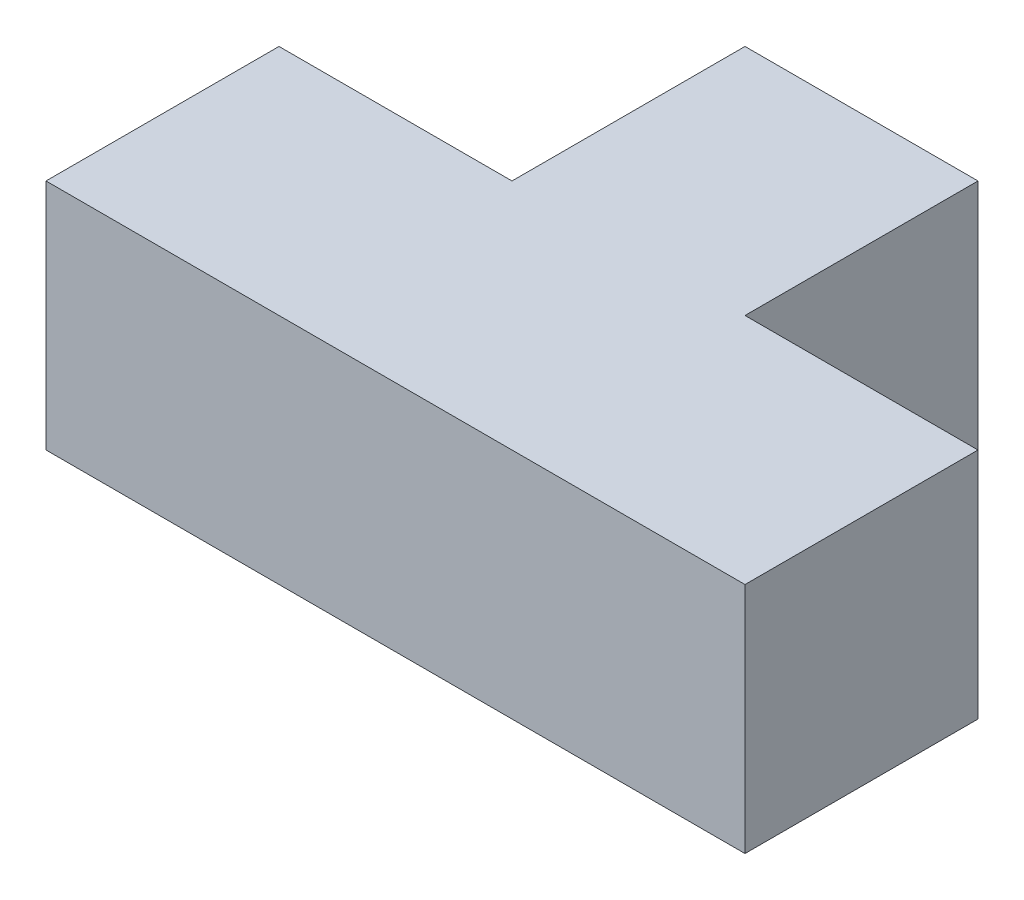
ISO-10303-21;
HEADER;
FILE_DESCRIPTION(('STEP AP214'),'2;1');
FILE_NAME('part.step','',(''),(''),'','','');
FILE_SCHEMA(('AUTOMOTIVE_DESIGN { 1 0 10303 214 1 1 1 1 }'));
ENDSEC;
DATA;
#1=APPLICATION_CONTEXT('core data for automotive mechanical design processes');
#2=APPLICATION_PROTOCOL_DEFINITION('international standard','automotive_design',2000,#1);
#3=PRODUCT_CONTEXT('',#1,'mechanical');
#4=PRODUCT('Part','Part','',(#3));
#5=PRODUCT_RELATED_PRODUCT_CATEGORY('part','',(#4));
#6=PRODUCT_DEFINITION_FORMATION('','',#4);
#7=PRODUCT_DEFINITION_CONTEXT('part definition',#1,'design');
#8=PRODUCT_DEFINITION('design','',#6,#7);
#9=PRODUCT_DEFINITION_SHAPE('','',#8);
#10=(LENGTH_UNIT() NAMED_UNIT(*) SI_UNIT(.MILLI.,.METRE.));
#11=(NAMED_UNIT(*) PLANE_ANGLE_UNIT() SI_UNIT($,.RADIAN.));
#12=(NAMED_UNIT(*) SI_UNIT($,.STERADIAN.) SOLID_ANGLE_UNIT());
#13=UNCERTAINTY_MEASURE_WITH_UNIT(LENGTH_MEASURE(1.E-05),#10,'distance_accuracy_value','');
#14=(GEOMETRIC_REPRESENTATION_CONTEXT(3) GLOBAL_UNCERTAINTY_ASSIGNED_CONTEXT((#13)) GLOBAL_UNIT_ASSIGNED_CONTEXT((#10,
#11,#12)) REPRESENTATION_CONTEXT('',''));
#15=CARTESIAN_POINT('',(0.,0.,0.));
#16=DIRECTION('',(0.,0.,1.));
#17=DIRECTION('',(1.,0.,0.));
#18=AXIS2_PLACEMENT_3D('',#15,#16,#17);
#19=CARTESIAN_POINT('',(0.,200.,0.));
#20=DIRECTION('',(1.,0.,0.));
#21=DIRECTION('',(0.,0.,-1.));
#22=AXIS2_PLACEMENT_3D('',#19,#20,#21);
#23=PLANE('',#22);
#24=DIRECTION('',(0.,0.,1.));
#25=VECTOR('',#24,1.);
#26=CARTESIAN_POINT('',(0.,0.,0.));
#27=LINE('',#26,#25);
#28=CARTESIAN_POINT('',(0.,0.,-200.));
#29=VERTEX_POINT('',#28);
#30=CARTESIAN_POINT('',(0.,0.,0.));
#31=VERTEX_POINT('',#30);
#32=EDGE_CURVE('E140',#29,#31,#27,.T.);
#33=ORIENTED_EDGE('',*,*,#32,.T.);
#34=DIRECTION('',(0.,-1.,0.));
#35=VECTOR('',#34,1.);
#36=CARTESIAN_POINT('',(0.,200.,0.));
#37=LINE('',#36,#35);
#38=CARTESIAN_POINT('',(0.,200.,0.));
#39=VERTEX_POINT('',#38);
#40=EDGE_CURVE('E11',#39,#31,#37,.T.);
#41=ORIENTED_EDGE('',*,*,#40,.F.);
#42=DIRECTION('',(0.,0.,1.));
#43=VECTOR('',#42,1.);
#44=CARTESIAN_POINT('',(0.,200.,0.));
#45=LINE('',#44,#43);
#46=CARTESIAN_POINT('',(0.,200.,-200.));
#47=VERTEX_POINT('',#46);
#48=EDGE_CURVE('E162',#47,#39,#45,.T.);
#49=ORIENTED_EDGE('',*,*,#48,.F.);
#50=DIRECTION('',(0.,-1.,0.));
#51=VECTOR('',#50,1.);
#52=CARTESIAN_POINT('',(0.,200.,-200.));
#53=LINE('',#52,#51);
#54=EDGE_CURVE('E136',#47,#29,#53,.T.);
#55=ORIENTED_EDGE('',*,*,#54,.T.);
#56=EDGE_LOOP('',(#33,#41,#49,#55));
#57=FACE_BOUND('',#56,.T.);
#58=ADVANCED_FACE('F39',(#57),#23,.F.);
#59=CARTESIAN_POINT('',(0.,200.,0.));
#60=DIRECTION('',(0.,0.,-1.));
#61=DIRECTION('',(-1.,0.,0.));
#62=AXIS2_PLACEMENT_3D('',#59,#60,#61);
#63=PLANE('',#62);
#64=DIRECTION('',(1.,0.,0.));
#65=VECTOR('',#64,1.);
#66=CARTESIAN_POINT('',(0.,0.,0.));
#67=LINE('',#66,#65);
#68=CARTESIAN_POINT('',(600.,0.,0.));
#69=VERTEX_POINT('',#68);
#70=EDGE_CURVE('E144',#31,#69,#67,.T.);
#71=ORIENTED_EDGE('',*,*,#70,.T.);
#72=DIRECTION('',(0.,-1.,0.));
#73=VECTOR('',#72,1.);
#74=CARTESIAN_POINT('',(600.,200.,0.));
#75=LINE('',#74,#73);
#76=CARTESIAN_POINT('',(600.,200.,0.));
#77=VERTEX_POINT('',#76);
#78=EDGE_CURVE('E48',#77,#69,#75,.T.);
#79=ORIENTED_EDGE('',*,*,#78,.F.);
#80=DIRECTION('',(1.,0.,0.));
#81=VECTOR('',#80,1.);
#82=CARTESIAN_POINT('',(0.,200.,0.));
#83=LINE('',#82,#81);
#84=EDGE_CURVE('E99',#39,#77,#83,.T.);
#85=ORIENTED_EDGE('',*,*,#84,.F.);
#86=ORIENTED_EDGE('',*,*,#40,.T.);
#87=EDGE_LOOP('',(#71,#79,#85,#86));
#88=FACE_BOUND('',#87,.T.);
#89=ADVANCED_FACE('F208',(#88),#63,.F.);
#90=CARTESIAN_POINT('',(600.,200.,0.));
#91=DIRECTION('',(-1.,0.,0.));
#92=DIRECTION('',(0.,0.,1.));
#93=AXIS2_PLACEMENT_3D('',#90,#91,#92);
#94=PLANE('',#93);
#95=DIRECTION('',(0.,0.,-1.));
#96=VECTOR('',#95,1.);
#97=CARTESIAN_POINT('',(600.,0.,0.));
#98=LINE('',#97,#96);
#99=CARTESIAN_POINT('',(600.,0.,-200.));
#100=VERTEX_POINT('',#99);
#101=EDGE_CURVE('E147',#69,#100,#98,.T.);
#102=ORIENTED_EDGE('',*,*,#101,.T.);
#103=DIRECTION('',(0.,-1.,0.));
#104=VECTOR('',#103,1.);
#105=CARTESIAN_POINT('',(600.,200.,-200.));
#106=LINE('',#105,#104);
#107=CARTESIAN_POINT('',(600.,200.,-200.));
#108=VERTEX_POINT('',#107);
#109=EDGE_CURVE('E173',#108,#100,#106,.T.);
#110=ORIENTED_EDGE('',*,*,#109,.F.);
#111=DIRECTION('',(0.,0.,-1.));
#112=VECTOR('',#111,1.);
#113=CARTESIAN_POINT('',(600.,200.,0.));
#114=LINE('',#113,#112);
#115=EDGE_CURVE('E183',#77,#108,#114,.T.);
#116=ORIENTED_EDGE('',*,*,#115,.F.);
#117=ORIENTED_EDGE('',*,*,#78,.T.);
#118=EDGE_LOOP('',(#102,#110,#116,#117));
#119=FACE_BOUND('',#118,.T.);
#120=ADVANCED_FACE('F181',(#119),#94,.F.);
#121=CARTESIAN_POINT('',(400.,200.,-200.));
#122=DIRECTION('',(0.,0.,1.));
#123=DIRECTION('',(1.,0.,0.));
#124=AXIS2_PLACEMENT_3D('',#121,#122,#123);
#125=PLANE('',#124);
#126=DIRECTION('',(-1.,0.,0.));
#127=VECTOR('',#126,1.);
#128=CARTESIAN_POINT('',(400.,0.,-200.));
#129=LINE('',#128,#127);
#130=CARTESIAN_POINT('',(400.,0.,-200.));
#131=VERTEX_POINT('',#130);
#132=EDGE_CURVE('E150',#100,#131,#129,.T.);
#133=ORIENTED_EDGE('',*,*,#132,.T.);
#134=DIRECTION('',(0.,-1.,0.));
#135=VECTOR('',#134,1.);
#136=CARTESIAN_POINT('',(400.,200.,-200.));
#137=LINE('',#136,#135);
#138=CARTESIAN_POINT('',(400.,200.,-200.));
#139=VERTEX_POINT('',#138);
#140=EDGE_CURVE('E169',#139,#131,#137,.T.);
#141=ORIENTED_EDGE('',*,*,#140,.F.);
#142=DIRECTION('',(-1.,0.,0.));
#143=VECTOR('',#142,1.);
#144=CARTESIAN_POINT('',(400.,200.,-200.));
#145=LINE('',#144,#143);
#146=EDGE_CURVE('E196',#108,#139,#145,.T.);
#147=ORIENTED_EDGE('',*,*,#146,.F.);
#148=ORIENTED_EDGE('',*,*,#109,.T.);
#149=EDGE_LOOP('',(#133,#141,#147,#148));
#150=FACE_BOUND('',#149,.T.);
#151=ADVANCED_FACE('F191',(#150),#125,.F.);
#152=CARTESIAN_POINT('',(400.,200.,-200.));
#153=DIRECTION('',(-1.,0.,0.));
#154=DIRECTION('',(0.,0.,1.));
#155=AXIS2_PLACEMENT_3D('',#152,#153,#154);
#156=PLANE('',#155);
#157=DIRECTION('',(0.,0.,-1.));
#158=VECTOR('',#157,1.);
#159=CARTESIAN_POINT('',(400.,0.,-200.));
#160=LINE('',#159,#158);
#161=CARTESIAN_POINT('',(400.,0.,-400.));
#162=VERTEX_POINT('',#161);
#163=EDGE_CURVE('E153',#131,#162,#160,.T.);
#164=ORIENTED_EDGE('',*,*,#163,.T.);
#165=DIRECTION('',(0.,-1.,0.));
#166=VECTOR('',#165,1.);
#167=CARTESIAN_POINT('',(400.,200.,-400.));
#168=LINE('',#167,#166);
#169=CARTESIAN_POINT('',(400.,200.,-400.));
#170=VERTEX_POINT('',#169);
#171=EDGE_CURVE('E129',#170,#162,#168,.T.);
#172=ORIENTED_EDGE('',*,*,#171,.F.);
#173=DIRECTION('',(0.,0.,-1.));
#174=VECTOR('',#173,1.);
#175=CARTESIAN_POINT('',(400.,200.,-200.));
#176=LINE('',#175,#174);
#177=EDGE_CURVE('E118',#139,#170,#176,.T.);
#178=ORIENTED_EDGE('',*,*,#177,.F.);
#179=ORIENTED_EDGE('',*,*,#140,.T.);
#180=EDGE_LOOP('',(#164,#172,#178,#179));
#181=FACE_BOUND('',#180,.T.);
#182=ADVANCED_FACE('F194',(#181),#156,.F.);
#183=CARTESIAN_POINT('',(200.,200.,-400.));
#184=DIRECTION('',(0.,0.,1.));
#185=DIRECTION('',(1.,0.,0.));
#186=AXIS2_PLACEMENT_3D('',#183,#184,#185);
#187=PLANE('',#186);
#188=DIRECTION('',(-1.,0.,0.));
#189=VECTOR('',#188,1.);
#190=CARTESIAN_POINT('',(200.,0.,-400.));
#191=LINE('',#190,#189);
#192=CARTESIAN_POINT('',(200.,0.,-400.));
#193=VERTEX_POINT('',#192);
#194=EDGE_CURVE('E127',#162,#193,#191,.T.);
#195=ORIENTED_EDGE('',*,*,#194,.T.);
#196=DIRECTION('',(0.,-1.,0.));
#197=VECTOR('',#196,1.);
#198=CARTESIAN_POINT('',(200.,200.,-400.));
#199=LINE('',#198,#197);
#200=CARTESIAN_POINT('',(200.,200.,-400.));
#201=VERTEX_POINT('',#200);
#202=EDGE_CURVE('E124',#201,#193,#199,.T.);
#203=ORIENTED_EDGE('',*,*,#202,.F.);
#204=DIRECTION('',(-1.,0.,0.));
#205=VECTOR('',#204,1.);
#206=CARTESIAN_POINT('',(200.,200.,-400.));
#207=LINE('',#206,#205);
#208=EDGE_CURVE('E112',#170,#201,#207,.T.);
#209=ORIENTED_EDGE('',*,*,#208,.F.);
#210=ORIENTED_EDGE('',*,*,#171,.T.);
#211=EDGE_LOOP('',(#195,#203,#209,#210));
#212=FACE_BOUND('',#211,.T.);
#213=ADVANCED_FACE('F125',(#212),#187,.F.);
#214=CARTESIAN_POINT('',(200.,200.,-200.));
#215=DIRECTION('',(1.,0.,0.));
#216=DIRECTION('',(0.,0.,-1.));
#217=AXIS2_PLACEMENT_3D('',#214,#215,#216);
#218=PLANE('',#217);
#219=DIRECTION('',(0.,0.,1.));
#220=VECTOR('',#219,1.);
#221=CARTESIAN_POINT('',(200.,0.,-200.));
#222=LINE('',#221,#220);
#223=CARTESIAN_POINT('',(200.,0.,-200.));
#224=VERTEX_POINT('',#223);
#225=EDGE_CURVE('E85',#193,#224,#222,.T.);
#226=ORIENTED_EDGE('',*,*,#225,.T.);
#227=DIRECTION('',(0.,-1.,0.));
#228=VECTOR('',#227,1.);
#229=CARTESIAN_POINT('',(200.,200.,-200.));
#230=LINE('',#229,#228);
#231=CARTESIAN_POINT('',(200.,200.,-200.));
#232=VERTEX_POINT('',#231);
#233=EDGE_CURVE('E130',#232,#224,#230,.T.);
#234=ORIENTED_EDGE('',*,*,#233,.F.);
#235=DIRECTION('',(0.,0.,1.));
#236=VECTOR('',#235,1.);
#237=CARTESIAN_POINT('',(200.,200.,-200.));
#238=LINE('',#237,#236);
#239=EDGE_CURVE('E116',#201,#232,#238,.T.);
#240=ORIENTED_EDGE('',*,*,#239,.F.);
#241=ORIENTED_EDGE('',*,*,#202,.T.);
#242=EDGE_LOOP('',(#226,#234,#240,#241));
#243=FACE_BOUND('',#242,.T.);
#244=ADVANCED_FACE('F132',(#243),#218,.F.);
#245=CARTESIAN_POINT('',(0.,200.,-200.));
#246=DIRECTION('',(0.,0.,1.));
#247=DIRECTION('',(1.,0.,0.));
#248=AXIS2_PLACEMENT_3D('',#245,#246,#247);
#249=PLANE('',#248);
#250=DIRECTION('',(-1.,0.,0.));
#251=VECTOR('',#250,1.);
#252=CARTESIAN_POINT('',(0.,0.,-200.));
#253=LINE('',#252,#251);
#254=EDGE_CURVE('E91',#224,#29,#253,.T.);
#255=ORIENTED_EDGE('',*,*,#254,.T.);
#256=ORIENTED_EDGE('',*,*,#54,.F.);
#257=DIRECTION('',(-1.,0.,0.));
#258=VECTOR('',#257,1.);
#259=CARTESIAN_POINT('',(0.,200.,-200.));
#260=LINE('',#259,#258);
#261=EDGE_CURVE('E56',#232,#47,#260,.T.);
#262=ORIENTED_EDGE('',*,*,#261,.F.);
#263=ORIENTED_EDGE('',*,*,#233,.T.);
#264=EDGE_LOOP('',(#255,#256,#262,#263));
#265=FACE_BOUND('',#264,.T.);
#266=ADVANCED_FACE('F224',(#265),#249,.F.);
#267=CARTESIAN_POINT('',(0.,200.,0.));
#268=DIRECTION('',(0.,-1.,0.));
#269=DIRECTION('',(0.,0.,-1.));
#270=AXIS2_PLACEMENT_3D('',#267,#268,#269);
#271=PLANE('',#270);
#272=ORIENTED_EDGE('',*,*,#48,.T.);
#273=ORIENTED_EDGE('',*,*,#84,.T.);
#274=ORIENTED_EDGE('',*,*,#115,.T.);
#275=ORIENTED_EDGE('',*,*,#146,.T.);
#276=ORIENTED_EDGE('',*,*,#177,.T.);
#277=ORIENTED_EDGE('',*,*,#208,.T.);
#278=ORIENTED_EDGE('',*,*,#239,.T.);
#279=ORIENTED_EDGE('',*,*,#261,.T.);
#280=EDGE_LOOP('',(#272,#273,#274,#275,#276,#277,#278,#279));
#281=FACE_BOUND('',#280,.T.);
#282=ADVANCED_FACE('F114',(#281),#271,.F.);
#283=CARTESIAN_POINT('',(0.,0.,0.));
#284=DIRECTION('',(0.,-1.,0.));
#285=DIRECTION('',(0.,0.,-1.));
#286=AXIS2_PLACEMENT_3D('',#283,#284,#285);
#287=PLANE('',#286);
#288=ORIENTED_EDGE('',*,*,#32,.F.);
#289=ORIENTED_EDGE('',*,*,#254,.F.);
#290=ORIENTED_EDGE('',*,*,#225,.F.);
#291=ORIENTED_EDGE('',*,*,#194,.F.);
#292=ORIENTED_EDGE('',*,*,#163,.F.);
#293=ORIENTED_EDGE('',*,*,#132,.F.);
#294=ORIENTED_EDGE('',*,*,#101,.F.);
#295=ORIENTED_EDGE('',*,*,#70,.F.);
#296=EDGE_LOOP('',(#288,#289,#290,#291,#292,#293,#294,#295));
#297=FACE_BOUND('',#296,.T.);
#298=ADVANCED_FACE('F187',(#297),#287,.T.);
#299=CLOSED_SHELL('',(#58,#89,#120,#151,#182,#213,#244,#266,#282,#298));
#300=MANIFOLD_SOLID_BREP('B2',#299);
#301=ADVANCED_BREP_SHAPE_REPRESENTATION('',(#18,#300),#14);
#302=SHAPE_DEFINITION_REPRESENTATION(#9,#301);
ENDSEC;
END-ISO-10303-21;
